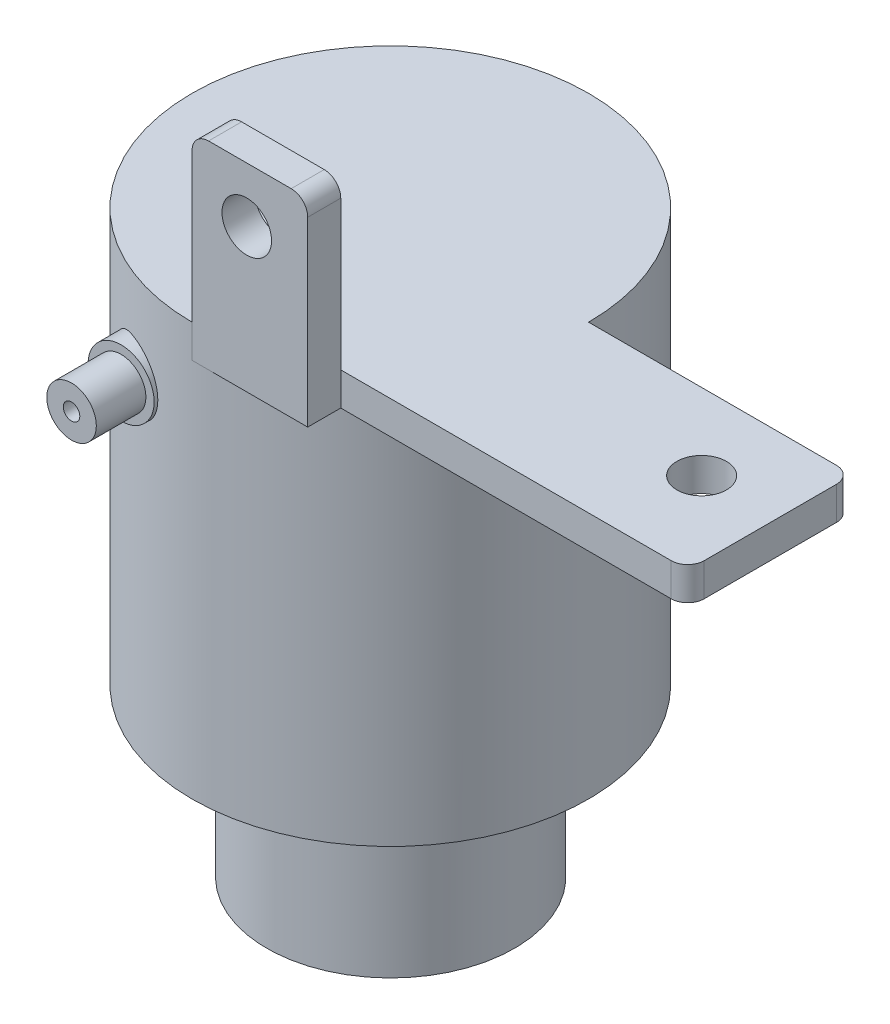
ISO-10303-21;
HEADER;
FILE_DESCRIPTION(('STEP AP214'),'2;1');
FILE_NAME('part.step','',(''),(''),'','','');
FILE_SCHEMA(('AUTOMOTIVE_DESIGN { 1 0 10303 214 1 1 1 1 }'));
ENDSEC;
DATA;
#1=APPLICATION_CONTEXT('core data for automotive mechanical design processes');
#2=APPLICATION_PROTOCOL_DEFINITION('international standard','automotive_design',2000,#1);
#3=PRODUCT_CONTEXT('',#1,'mechanical');
#4=PRODUCT('Part','Part','',(#3));
#5=PRODUCT_RELATED_PRODUCT_CATEGORY('part','',(#4));
#6=PRODUCT_DEFINITION_FORMATION('','',#4);
#7=PRODUCT_DEFINITION_CONTEXT('part definition',#1,'design');
#8=PRODUCT_DEFINITION('design','',#6,#7);
#9=PRODUCT_DEFINITION_SHAPE('','',#8);
#10=(LENGTH_UNIT() NAMED_UNIT(*) SI_UNIT(.MILLI.,.METRE.));
#11=(NAMED_UNIT(*) PLANE_ANGLE_UNIT() SI_UNIT($,.RADIAN.));
#12=(NAMED_UNIT(*) SI_UNIT($,.STERADIAN.) SOLID_ANGLE_UNIT());
#13=UNCERTAINTY_MEASURE_WITH_UNIT(LENGTH_MEASURE(1.E-05),#10,'distance_accuracy_value','');
#14=(GEOMETRIC_REPRESENTATION_CONTEXT(3) GLOBAL_UNCERTAINTY_ASSIGNED_CONTEXT((#13)) GLOBAL_UNIT_ASSIGNED_CONTEXT((#10,
#11,#12)) REPRESENTATION_CONTEXT('',''));
#15=CARTESIAN_POINT('',(0.,0.,0.));
#16=DIRECTION('',(0.,0.,1.));
#17=DIRECTION('',(1.,0.,0.));
#18=AXIS2_PLACEMENT_3D('',#15,#16,#17);
#19=CARTESIAN_POINT('',(-4.00939344564377,-96.6692765539277,-12.1304033412201));
#20=DIRECTION('',(0.,1.,0.));
#21=DIRECTION('',(0.,0.,1.));
#22=AXIS2_PLACEMENT_3D('',#19,#20,#21);
#23=CYLINDRICAL_SURFACE('',#22,84.);
#24=CARTESIAN_POINT('',(-4.00939344564377,78.3307234460723,-12.1304033412201));
#25=DIRECTION('',(0.,1.,0.));
#26=DIRECTION('',(0.,0.,1.));
#27=AXIS2_PLACEMENT_3D('',#24,#25,#26);
#28=CIRCLE('',#27,84.);
#29=CARTESIAN_POINT('',(79.9906065543562,78.3307234460723,-12.1304033412201));
#30=VERTEX_POINT('',#29);
#31=CARTESIAN_POINT('',(-4.00939344564377,78.3307234460723,71.8695966587799));
#32=VERTEX_POINT('',#31);
#33=EDGE_CURVE('E148',#30,#32,#28,.T.);
#34=ORIENTED_EDGE('',*,*,#33,.F.);
#35=DIRECTION('',(0.,1.,0.));
#36=VECTOR('',#35,1.);
#37=CARTESIAN_POINT('',(79.9906065543562,-96.6692765539277,-12.1304033412201));
#38=LINE('',#37,#36);
#39=CARTESIAN_POINT('',(79.9906065543562,64.3307234460723,-12.1304033412201));
#40=VERTEX_POINT('',#39);
#41=EDGE_CURVE('E173',#30,#40,#38,.F.);
#42=ORIENTED_EDGE('',*,*,#41,.T.);
#43=CARTESIAN_POINT('',(-4.00939344564377,64.3307234460723,-12.1304033412201));
#44=DIRECTION('',(0.,1.,0.));
#45=DIRECTION('',(0.,0.,1.));
#46=AXIS2_PLACEMENT_3D('',#43,#44,#45);
#47=CIRCLE('',#46,84.);
#48=CARTESIAN_POINT('',(-4.00939344564377,64.3307234460723,71.8695966587799));
#49=VERTEX_POINT('',#48);
#50=EDGE_CURVE('E151',#49,#40,#47,.T.);
#51=ORIENTED_EDGE('',*,*,#50,.F.);
#52=DIRECTION('',(0.,-1.,0.));
#53=VECTOR('',#52,1.);
#54=CARTESIAN_POINT('',(-4.00939344564377,64.3307234460723,71.8695966587799));
#55=LINE('',#54,#53);
#56=EDGE_CURVE('E135',#32,#49,#55,.T.);
#57=ORIENTED_EDGE('',*,*,#56,.F.);
#58=EDGE_LOOP('',(#34,#42,#51,#57));
#59=FACE_BOUND('',#58,.T.);
#60=CARTESIAN_POINT('',(-4.00939344564377,-96.6692765539277,-12.1304033412201));
#61=DIRECTION('',(0.,1.,0.));
#62=DIRECTION('',(0.,0.,1.));
#63=AXIS2_PLACEMENT_3D('',#60,#61,#62);
#64=CIRCLE('',#63,84.);
#65=CARTESIAN_POINT('',(-4.00939344564377,-96.6692765539277,71.8695966587799));
#66=VERTEX_POINT('',#65);
#67=EDGE_CURVE('E164',#66,#66,#64,.T.);
#68=ORIENTED_EDGE('',*,*,#67,.T.);
#69=EDGE_LOOP('',(#68));
#70=FACE_BOUND('',#69,.T.);
#71=CARTESIAN_POINT('',(-48.0745118024601,40.9985069538936,59.3836885861739));
#72=CARTESIAN_POINT('',(-48.0745185371785,41.3533320048685,59.3836829810344));
#73=CARTESIAN_POINT('',(-48.06101080227,41.7080873698228,59.3920124379609));
#74=CARTESIAN_POINT('',(-48.0071860703539,42.4149002024277,59.4251365611333));
#75=CARTESIAN_POINT('',(-47.9668625635464,42.7669569939753,59.4499352254437));
#76=CARTESIAN_POINT('',(-47.8599096398544,43.4658841899632,59.5155046929798));
#77=CARTESIAN_POINT('',(-47.7932538210653,43.8127490253312,59.5562915263106));
#78=CARTESIAN_POINT('',(-47.63454036209,44.4984295730678,59.6529873291647));
#79=CARTESIAN_POINT('',(-47.5424839769149,44.8372456822159,59.7088955515559));
#80=CARTESIAN_POINT('',(-47.3345609505447,45.5032014691506,59.8344806376597));
#81=CARTESIAN_POINT('',(-47.2187979067674,45.8303849166348,59.904097545587));
#82=CARTESIAN_POINT('',(-46.9645196155599,46.4727213748997,60.0560154096472));
#83=CARTESIAN_POINT('',(-46.8260041682698,46.7878742799728,60.1383164771989));
#84=CARTESIAN_POINT('',(-46.5276342985117,47.4045235770432,60.3142594512845));
#85=CARTESIAN_POINT('',(-46.3677834942102,47.7060222730104,60.4078994346539));
#86=CARTESIAN_POINT('',(-46.0280782140283,48.2942356167696,60.6052049796269));
#87=CARTESIAN_POINT('',(-45.8482160220058,48.5809444989905,60.7088744064351));
#88=CARTESIAN_POINT('',(-45.4567368974437,49.1578446868984,60.9323914678286));
#89=CARTESIAN_POINT('',(-45.2437802606205,49.44688484563,61.0528631360036));
#90=CARTESIAN_POINT('',(-44.7982178753027,50.005720321412,61.3021302070841));
#91=CARTESIAN_POINT('',(-44.5656054507967,50.2755090419359,61.430928434555));
#92=CARTESIAN_POINT('',(-44.0823250297289,50.7949108781494,61.6953104605126));
#93=CARTESIAN_POINT('',(-43.8316537803295,51.0445203417899,61.830895480118));
#94=CARTESIAN_POINT('',(-43.3137927287167,51.5227613534907,62.1073927663208));
#95=CARTESIAN_POINT('',(-43.0466021472425,51.7513919106544,62.2483052841085));
#96=CARTESIAN_POINT('',(-42.4596342302265,52.2167268512582,62.5536162469773));
#97=CARTESIAN_POINT('',(-42.1376551990175,52.4502786617011,62.7185964510598));
#98=CARTESIAN_POINT('',(-41.4763180624738,52.8884432410142,63.0518196091505));
#99=CARTESIAN_POINT('',(-41.1369636051738,53.0930620508142,63.2200618737058));
#100=CARTESIAN_POINT('',(-40.4425111927271,53.4726917689092,63.5582826424593));
#101=CARTESIAN_POINT('',(-40.0874015318331,53.6476801813661,63.7282623628662));
#102=CARTESIAN_POINT('',(-39.3637883257998,53.9669260802625,64.0681958467769));
#103=CARTESIAN_POINT('',(-38.995289147123,54.1111934817033,64.2381496009114));
#104=CARTESIAN_POINT('',(-38.2183539899061,54.3779621539463,64.5894914594123));
#105=CARTESIAN_POINT('',(-37.8090106672718,54.4979775384892,64.7707674578722));
#106=CARTESIAN_POINT('',(-36.9796639801391,54.7004156364425,65.1299712886171));
#107=CARTESIAN_POINT('',(-36.559659995531,54.7828361577197,65.3078989250814));
#108=CARTESIAN_POINT('',(-35.7118398414194,54.9090362948267,65.658833441201));
#109=CARTESIAN_POINT('',(-35.2840236192153,54.9528156498885,65.831840287641));
#110=CARTESIAN_POINT('',(-34.4236646716375,55.0007818188149,66.1714866118659));
#111=CARTESIAN_POINT('',(-33.9911221209277,55.0049700908668,66.338126323935));
#112=CARTESIAN_POINT('',(-33.1315038127928,54.9732259810708,66.6611581298369));
#113=CARTESIAN_POINT('',(-32.7044501603484,54.9379288919411,66.8176708384612));
#114=CARTESIAN_POINT('',(-31.8523964595786,54.8277051563706,67.1221792480283));
#115=CARTESIAN_POINT('',(-31.4273964181709,54.7527783765277,67.270174920299));
#116=CARTESIAN_POINT('',(-30.5832601556587,54.5631017268957,67.5566609349456));
#117=CARTESIAN_POINT('',(-30.164122040835,54.4483650421746,67.6951544062896));
#118=CARTESIAN_POINT('',(-29.335442495145,54.1792113422142,67.9619226300786));
#119=CARTESIAN_POINT('',(-28.9259004052824,54.0247970605561,68.0901980856947));
#120=CARTESIAN_POINT('',(-28.1471980276106,53.6884515799436,68.3277906325311));
#121=CARTESIAN_POINT('',(-27.7771630962197,53.5090319155961,68.4378011414181));
#122=CARTESIAN_POINT('',(-27.0522338099615,53.1169800353188,68.6481206525346));
#123=CARTESIAN_POINT('',(-26.6973388359248,52.9043491792673,68.7484300517174));
#124=CARTESIAN_POINT('',(-26.0060628696846,52.4471667389018,68.9391661566541));
#125=CARTESIAN_POINT('',(-25.6696769878071,52.2026236431814,69.0295954787787));
#126=CARTESIAN_POINT('',(-25.0185204523634,51.6831899038315,69.200586522511));
#127=CARTESIAN_POINT('',(-24.7037489550203,51.4083004459496,69.2811486294091));
#128=CARTESIAN_POINT('',(-24.1161999384741,50.8467351305046,69.4281814993576));
#129=CARTESIAN_POINT('',(-23.8420498626785,50.5616356270546,69.4951950137088));
#130=CARTESIAN_POINT('',(-23.3180508347961,49.9681901339464,69.6207333475101));
#131=CARTESIAN_POINT('',(-23.0682008814551,49.6598451030193,69.6792585167602));
#132=CARTESIAN_POINT('',(-22.5950099578225,49.0221388158126,69.7880550050499));
#133=CARTESIAN_POINT('',(-22.3716656739455,48.6927801944629,69.838327356111));
#134=CARTESIAN_POINT('',(-21.9533998318556,48.0154206298018,69.9309062990994));
#135=CARTESIAN_POINT('',(-21.7584780080625,47.6674198607248,69.9732129654595));
#136=CARTESIAN_POINT('',(-21.4036271728893,46.9650213721491,70.0491115722948));
#137=CARTESIAN_POINT('',(-21.2428936567747,46.6110519156632,70.0829084410756));
#138=CARTESIAN_POINT('',(-20.9512540737091,45.89045714148,70.1435023479722));
#139=CARTESIAN_POINT('',(-20.8203473807045,45.523832089605,70.1702995330104));
#140=CARTESIAN_POINT('',(-20.5894308302362,44.7805734521763,70.2171300298544));
#141=CARTESIAN_POINT('',(-20.4894197467886,44.4039402644047,70.2371636100532));
#142=CARTESIAN_POINT('',(-20.3210972706126,43.6433676498071,70.2706627519687));
#143=CARTESIAN_POINT('',(-20.2527858832893,43.2594282217352,70.2841283125656));
#144=CARTESIAN_POINT('',(-20.1488202780001,42.4900294709585,70.3045509497591));
#145=CARTESIAN_POINT('',(-20.1129160444299,42.1046052306833,70.3115578627847));
#146=CARTESIAN_POINT('',(-20.073141995697,41.332046417024,70.3193170728606));
#147=CARTESIAN_POINT('',(-20.0692719623993,40.9449118553042,70.3200694125012));
#148=CARTESIAN_POINT('',(-20.0935964328707,40.1716949981188,70.3153276947922));
#149=CARTESIAN_POINT('',(-20.1217905260471,39.7856126892422,70.3098337174291));
#150=CARTESIAN_POINT('',(-20.2100195033879,39.0172457909177,70.2925408616762));
#151=CARTESIAN_POINT('',(-20.2700544122225,38.6349612044125,70.2807419784014));
#152=CARTESIAN_POINT('',(-20.4213996352495,37.877358162748,70.250735202608));
#153=CARTESIAN_POINT('',(-20.5126731300712,37.5020320525163,70.2325348544826));
#154=CARTESIAN_POINT('',(-20.7257850871442,36.7605477768096,70.1895459681268));
#155=CARTESIAN_POINT('',(-20.8476234854548,36.3943895921574,70.1647574436787));
#156=CARTESIAN_POINT('',(-21.120888402552,35.6738375699762,70.1083721078625));
#157=CARTESIAN_POINT('',(-21.2723142348275,35.3194434597109,70.0767754544604));
#158=CARTESIAN_POINT('',(-21.6035385792372,34.6249011098655,70.0065231886587));
#159=CARTESIAN_POINT('',(-21.7833371237169,34.2847528865265,69.9678675682119));
#160=CARTESIAN_POINT('',(-22.1701435778227,33.620571841485,69.8831710890105));
#161=CARTESIAN_POINT('',(-22.377191858111,33.2965639332649,69.8371192499598));
#162=CARTESIAN_POINT('',(-22.8166031016899,32.6674378479661,69.7374145015534));
#163=CARTESIAN_POINT('',(-23.0489660312977,32.3623196457542,69.6837616023114));
#164=CARTESIAN_POINT('',(-23.5371083015719,31.7730252837142,69.568624881425));
#165=CARTESIAN_POINT('',(-23.7928871511906,31.4888486849521,69.5071412239862));
#166=CARTESIAN_POINT('',(-24.3257869124345,30.9432707111443,69.3761572545259));
#167=CARTESIAN_POINT('',(-24.6029079609649,30.6818694822201,69.3066568910778));
#168=CARTESIAN_POINT('',(-25.178745388788,30.18129194302,69.1588803027694));
#169=CARTESIAN_POINT('',(-25.4776282810354,29.9423281510652,69.0805331648076));
#170=CARTESIAN_POINT('',(-26.0924118757365,29.4906145853644,68.9155192959255));
#171=CARTESIAN_POINT('',(-26.4083126156668,29.2778648693506,68.8288525466834));
#172=CARTESIAN_POINT('',(-27.0546405796088,28.8796998849332,68.6472498217527));
#173=CARTESIAN_POINT('',(-27.3850684347263,28.694285805606,68.5523134866299));
#174=CARTESIAN_POINT('',(-28.0578918529696,28.3516568831111,68.3543324312234));
#175=CARTESIAN_POINT('',(-28.4002876364162,28.1944425594069,68.2512875616238));
#176=CARTESIAN_POINT('',(-29.1039595806575,27.9049104495359,68.0344389257392));
#177=CARTESIAN_POINT('',(-29.4654959792042,27.7733874964879,67.9204185488854));
#178=CARTESIAN_POINT('',(-30.1957915540292,27.5410789995939,67.6845063294036));
#179=CARTESIAN_POINT('',(-30.5645508310981,27.440293885,67.5626143768782));
#180=CARTESIAN_POINT('',(-31.3067165144118,27.2695476446059,67.3114599346531));
#181=CARTESIAN_POINT('',(-31.6801235844432,27.1995909748158,67.1821963824941));
#182=CARTESIAN_POINT('',(-32.4290435660779,27.0903920593567,66.9169326586531));
#183=CARTESIAN_POINT('',(-32.8045566400224,27.0511522152038,66.7809319611284));
#184=CARTESIAN_POINT('',(-33.5754802629301,27.0017908721176,66.4954473040281));
#185=CARTESIAN_POINT('',(-33.970875660021,26.9933474603474,66.3456315203428));
#186=CARTESIAN_POINT('',(-34.7587516965035,27.0096867502784,66.0402784880127));
#187=CARTESIAN_POINT('',(-35.1512322431868,27.0344705042735,65.8847410583169));
#188=CARTESIAN_POINT('',(-35.9309578521109,27.1166005320175,65.5689576090649));
#189=CARTESIAN_POINT('',(-36.3182016138194,27.1739547477898,65.4087104501228));
#190=CARTESIAN_POINT('',(-37.0851219094717,27.3204714204781,65.0846827116464));
#191=CARTESIAN_POINT('',(-37.464798099611,27.409635319087,64.9209019722778));
#192=CARTESIAN_POINT('',(-38.2393504903571,27.6259106850859,64.5800959142851));
#193=CARTESIAN_POINT('',(-38.6335652980294,27.7551462990799,64.4029124612003));
#194=CARTESIAN_POINT('',(-39.4086048724799,28.0478673217371,64.0475305864781));
#195=CARTESIAN_POINT('',(-39.7894290179677,28.2113543171298,63.8693321181913));
#196=CARTESIAN_POINT('',(-40.53544625474,28.571603268918,63.5136199993482));
#197=CARTESIAN_POINT('',(-40.9006363622336,28.7683715419553,63.3361064853472));
#198=CARTESIAN_POINT('',(-41.6131972565618,29.1942454873757,62.9835902618356));
#199=CARTESIAN_POINT('',(-41.9605598353402,29.4233658762302,62.8085887351219));
#200=CARTESIAN_POINT('',(-42.6456141720262,29.9205605829677,62.4577669157834));
#201=CARTESIAN_POINT('',(-42.9826584351333,30.1896331994836,62.2820938931676));
#202=CARTESIAN_POINT('',(-43.6323819428274,30.7596676603189,61.9381720829945));
#203=CARTESIAN_POINT('',(-43.945072993327,31.0606138839027,61.7699197154383));
#204=CARTESIAN_POINT('',(-44.5437134324818,31.6933740574208,61.4432685127777));
#205=CARTESIAN_POINT('',(-44.8296509497028,32.0252015813713,61.2848740622997));
#206=CARTESIAN_POINT('',(-45.2360185633982,32.5445663771728,61.0569558977537));
#207=CARTESIAN_POINT('',(-45.367715427351,32.7212879020404,60.9825969080452));
#208=CARTESIAN_POINT('',(-45.6233126103842,33.0818125348598,60.8374206101365));
#209=CARTESIAN_POINT('',(-45.7472096244708,33.2656185922276,60.7666048058476));
#210=CARTESIAN_POINT('',(-46.0913262591282,33.8034162496245,60.5688254324341));
#211=CARTESIAN_POINT('',(-46.3012423618047,34.1659365412059,60.4467974447678));
#212=CARTESIAN_POINT('',(-46.6894121197608,34.912355472205,60.2192109149452));
#213=CARTESIAN_POINT('',(-46.8676722367392,35.2962497276527,60.113649012227));
#214=CARTESIAN_POINT('',(-47.1896185460312,36.0818332939059,59.921683713464));
#215=CARTESIAN_POINT('',(-47.3333854020802,36.4834784341397,59.8352356569226));
#216=CARTESIAN_POINT('',(-47.5843818277945,37.3016925141942,59.6835362392068));
#217=CARTESIAN_POINT('',(-47.6916310623103,37.7182532879046,59.6182734705761));
#218=CARTESIAN_POINT('',(-47.8770867414274,38.6075636173896,59.5050533702216));
#219=CARTESIAN_POINT('',(-47.9509628239046,39.0815594058521,59.4596918385683));
#220=CARTESIAN_POINT('',(-48.0496692371887,40.0365820804258,59.399014196519));
#221=CARTESIAN_POINT('',(-48.0745026748196,40.5176085192043,59.3836961828835));
#222=CARTESIAN_POINT('',(-48.0745118024601,40.9985069538936,59.3836885861739));
#223=B_SPLINE_CURVE_WITH_KNOTS('',3,(#71,#72,#73,#74,#75,#76,#77,#78,#79,#80,#81,#82,#83,#84,
#85,#86,#87,#88,#89,#90,#91,#92,#93,#94,#95,#96,#97,#98,#99,#100,#101,#102,#103,#104,#105,#106,
#107,#108,#109,#110,#111,#112,#113,#114,#115,#116,#117,#118,#119,#120,#121,#122,#123,#124,#125,
#126,#127,#128,#129,#130,#131,#132,#133,#134,#135,#136,#137,#138,#139,#140,#141,#142,#143,#144,
#145,#146,#147,#148,#149,#150,#151,#152,#153,#154,#155,#156,#157,#158,#159,#160,#161,#162,#163,
#164,#165,#166,#167,#168,#169,#170,#171,#172,#173,#174,#175,#176,#177,#178,#179,#180,#181,#182,
#183,#184,#185,#186,#187,#188,#189,#190,#191,#192,#193,#194,#195,#196,#197,#198,#199,#200,#201,
#202,#203,#204,#205,#206,#207,#208,#209,#210,#211,#212,#213,#214,#215,#216,#217,#218,#219,#220,
#221,#222),.UNSPECIFIED.,.T.,.F.,(4,2,2,2,2,2,2,2,2,2,2,2,2,2,2,2,2,2,2,2,2,2,2,2,2,2,2,2,2,2,2,
2,2,2,2,2,2,2,2,2,2,2,2,2,2,2,2,2,2,2,2,2,2,2,2,2,2,2,2,2,2,2,2,2,2,2,2,2,2,2,2,2,2,2,2,4),(0.,
1.06400280685061,2.12826400547629,3.19359499733874,4.25887336191674,5.3195921966704,
6.38032034940268,7.44086884607245,8.50182770363306,9.63676488294703,10.7720891006903,
11.9076183319709,13.043201170118,14.3336812830286,15.6238915570999,16.9150770282049,
18.2058451440925,19.5946635335197,20.9835628937387,22.3724716268076,23.7613292044976,
25.1281583665292,26.4949921296348,27.8613736278978,29.2276610147734,30.5031243821014,
31.778535537498,33.0536081249167,34.3286309080335,35.5306405023939,36.732600548539,
37.9344101739485,39.1362085688989,40.3054700978695,41.4747070822252,42.6438976635504,
43.813088444232,44.9731800487119,46.1332637536049,47.2933326033736,48.4534023519592,
49.6121094659837,50.7708141560534,51.9294919641313,53.0881710931311,54.2485865534838,
55.4090004698455,56.5693900571194,57.7297870886395,58.90025252606,60.0707205411867,
61.2412394556441,62.4117799298421,63.6142057740795,64.8166484093622,66.0192647913429,
67.2219751874034,68.489317187549,69.7566993249624,71.0243906352474,72.2921394077111,
73.6439476713906,74.9958185727856,76.3479463419053,77.7006911661908,79.0959699558674,
80.4905680788681,81.8857821254818,82.5833594504352,83.2812303942491,84.5881544639028,
85.8948114535412,87.1983823267492,88.5012501087381,89.9433965988896,91.3854517269408),.UNSPECIFIED.);
#224=CARTESIAN_POINT('',(-48.0745118024601,40.9985069538936,59.3836885861739));
#225=VERTEX_POINT('',#224);
#226=EDGE_CURVE('E270',#225,#225,#223,.T.);
#227=ORIENTED_EDGE('',*,*,#226,.T.);
#228=EDGE_LOOP('',(#227));
#229=FACE_BOUND('',#228,.T.);
#230=ADVANCED_FACE('F40',(#59,#70,#229),#23,.T.);
#231=CARTESIAN_POINT('',(-4.00939344564377,78.3307234460723,57.8695966587799));
#232=DIRECTION('',(0.,0.,-1.));
#233=DIRECTION('',(-1.,0.,0.));
#234=AXIS2_PLACEMENT_3D('',#231,#232,#233);
#235=PLANE('',#234);
#236=DIRECTION('',(1.,0.,0.));
#237=VECTOR('',#236,1.);
#238=CARTESIAN_POINT('',(-4.00939344564377,64.3307234460723,57.8695966587799));
#239=LINE('',#238,#237);
#240=CARTESIAN_POINT('',(44.9906065543562,64.3307234460723,57.8695966587799));
#241=VERTEX_POINT('',#240);
#242=CARTESIAN_POINT('',(184.990606554356,64.3307234460723,57.8695966587799));
#243=VERTEX_POINT('',#242);
#244=EDGE_CURVE('E206',#241,#243,#239,.T.);
#245=ORIENTED_EDGE('',*,*,#244,.T.);
#246=DIRECTION('',(0.,-1.,0.));
#247=VECTOR('',#246,1.);
#248=CARTESIAN_POINT('',(184.990606554356,78.3307234460723,57.8695966587799));
#249=LINE('',#248,#247);
#250=CARTESIAN_POINT('',(184.990606554356,78.3307234460723,57.8695966587799));
#251=VERTEX_POINT('',#250);
#252=EDGE_CURVE('E245',#243,#251,#249,.F.);
#253=ORIENTED_EDGE('',*,*,#252,.T.);
#254=DIRECTION('',(1.,0.,0.));
#255=VECTOR('',#254,1.);
#256=CARTESIAN_POINT('',(-4.00939344564377,78.3307234460723,57.8695966587799));
#257=LINE('',#256,#255);
#258=CARTESIAN_POINT('',(44.9906065543562,78.3307234460723,57.8695966587799));
#259=VERTEX_POINT('',#258);
#260=EDGE_CURVE('E209',#259,#251,#257,.T.);
#261=ORIENTED_EDGE('',*,*,#260,.F.);
#262=DIRECTION('',(0.,1.,0.));
#263=VECTOR('',#262,1.);
#264=CARTESIAN_POINT('',(44.9906065543562,64.3307234460723,57.8695966587799));
#265=LINE('',#264,#263);
#266=EDGE_CURVE('E193',#241,#259,#265,.T.);
#267=ORIENTED_EDGE('',*,*,#266,.F.);
#268=EDGE_LOOP('',(#245,#253,#261,#267));
#269=FACE_BOUND('',#268,.T.);
#270=ADVANCED_FACE('F326',(#269),#235,.F.);
#271=CARTESIAN_POINT('',(-4.00939344564377,78.3307234460723,-12.1304033412201));
#272=DIRECTION('',(0.,0.,-1.));
#273=DIRECTION('',(-1.,0.,0.));
#274=AXIS2_PLACEMENT_3D('',#271,#272,#273);
#275=PLANE('',#274);
#276=DIRECTION('',(1.,0.,0.));
#277=VECTOR('',#276,1.);
#278=CARTESIAN_POINT('',(-4.00939344564377,78.3307234460723,-12.1304033412201));
#279=LINE('',#278,#277);
#280=CARTESIAN_POINT('',(184.990606554356,78.3307234460723,-12.1304033412201));
#281=VERTEX_POINT('',#280);
#282=EDGE_CURVE('E162',#30,#281,#279,.T.);
#283=ORIENTED_EDGE('',*,*,#282,.T.);
#284=DIRECTION('',(0.,-1.,0.));
#285=VECTOR('',#284,1.);
#286=CARTESIAN_POINT('',(184.990606554356,64.3307234460723,-12.1304033412201));
#287=LINE('',#286,#285);
#288=CARTESIAN_POINT('',(184.990606554356,64.3307234460723,-12.1304033412201));
#289=VERTEX_POINT('',#288);
#290=EDGE_CURVE('E223',#281,#289,#287,.T.);
#291=ORIENTED_EDGE('',*,*,#290,.T.);
#292=DIRECTION('',(1.,0.,0.));
#293=VECTOR('',#292,1.);
#294=CARTESIAN_POINT('',(-4.00939344564377,64.3307234460723,-12.1304033412201));
#295=LINE('',#294,#293);
#296=EDGE_CURVE('E202',#40,#289,#295,.T.);
#297=ORIENTED_EDGE('',*,*,#296,.F.);
#298=ORIENTED_EDGE('',*,*,#41,.F.);
#299=EDGE_LOOP('',(#283,#291,#297,#298));
#300=FACE_BOUND('',#299,.T.);
#301=ADVANCED_FACE('F330',(#300),#275,.T.);
#302=CARTESIAN_POINT('',(-4.00939344564377,78.3307234460723,57.8695966587799));
#303=DIRECTION('',(-1.,0.,0.));
#304=DIRECTION('',(0.,0.,1.));
#305=AXIS2_PLACEMENT_3D('',#302,#303,#304);
#306=PLANE('',#305);
#307=CARTESIAN_POINT('',(-4.00939344564377,141.330723446072,71.8695966587799));
#308=VERTEX_POINT('',#307);
#309=EDGE_CURVE('E132',#308,#32,#55,.T.);
#310=ORIENTED_EDGE('',*,*,#309,.F.);
#311=DIRECTION('',(0.,0.,-1.));
#312=VECTOR('',#311,1.);
#313=CARTESIAN_POINT('',(-4.00939344564377,141.330723446072,57.8695966587799));
#314=LINE('',#313,#312);
#315=CARTESIAN_POINT('',(-4.00939344564377,141.330723446072,57.8695966587799));
#316=VERTEX_POINT('',#315);
#317=EDGE_CURVE('E264',#308,#316,#314,.T.);
#318=ORIENTED_EDGE('',*,*,#317,.T.);
#319=DIRECTION('',(0.,-1.,0.));
#320=VECTOR('',#319,1.);
#321=CARTESIAN_POINT('',(-4.00939344564377,64.3307234460723,57.8695966587799));
#322=LINE('',#321,#320);
#323=CARTESIAN_POINT('',(-4.00939344564377,78.3307234460723,57.8695966587799));
#324=VERTEX_POINT('',#323);
#325=EDGE_CURVE('E168',#316,#324,#322,.T.);
#326=ORIENTED_EDGE('',*,*,#325,.T.);
#327=DIRECTION('',(0.,0.,-1.));
#328=VECTOR('',#327,1.);
#329=CARTESIAN_POINT('',(-4.00939344564377,78.3307234460723,57.8695966587799));
#330=LINE('',#329,#328);
#331=EDGE_CURVE('E159',#32,#324,#330,.T.);
#332=ORIENTED_EDGE('',*,*,#331,.F.);
#333=EDGE_LOOP('',(#310,#318,#326,#332));
#334=FACE_BOUND('',#333,.T.);
#335=ADVANCED_FACE('F167',(#334),#306,.T.);
#336=CARTESIAN_POINT('',(191.990606554356,78.3307234460723,57.8695966587799));
#337=DIRECTION('',(-1.,0.,0.));
#338=DIRECTION('',(0.,0.,1.));
#339=AXIS2_PLACEMENT_3D('',#336,#337,#338);
#340=PLANE('',#339);
#341=DIRECTION('',(0.,0.,-1.));
#342=VECTOR('',#341,1.);
#343=CARTESIAN_POINT('',(191.990606554356,78.3307234460723,57.8695966587799));
#344=LINE('',#343,#342);
#345=CARTESIAN_POINT('',(191.990606554356,78.3307234460723,50.8695966587799));
#346=VERTEX_POINT('',#345);
#347=CARTESIAN_POINT('',(191.990606554356,78.3307234460723,-5.13040334122015));
#348=VERTEX_POINT('',#347);
#349=EDGE_CURVE('E205',#346,#348,#344,.T.);
#350=ORIENTED_EDGE('',*,*,#349,.F.);
#351=DIRECTION('',(0.,-1.,0.));
#352=VECTOR('',#351,1.);
#353=CARTESIAN_POINT('',(191.990606554356,78.3307234460723,50.8695966587799));
#354=LINE('',#353,#352);
#355=CARTESIAN_POINT('',(191.990606554356,64.3307234460723,50.8695966587799));
#356=VERTEX_POINT('',#355);
#357=EDGE_CURVE('E238',#346,#356,#354,.T.);
#358=ORIENTED_EDGE('',*,*,#357,.T.);
#359=DIRECTION('',(0.,0.,-1.));
#360=VECTOR('',#359,1.);
#361=CARTESIAN_POINT('',(191.990606554356,64.3307234460723,57.8695966587799));
#362=LINE('',#361,#360);
#363=CARTESIAN_POINT('',(191.990606554356,64.3307234460723,-5.13040334122015));
#364=VERTEX_POINT('',#363);
#365=EDGE_CURVE('E217',#356,#364,#362,.T.);
#366=ORIENTED_EDGE('',*,*,#365,.T.);
#367=DIRECTION('',(0.,-1.,0.));
#368=VECTOR('',#367,1.);
#369=CARTESIAN_POINT('',(191.990606554356,78.3307234460723,-5.13040334122015));
#370=LINE('',#369,#368);
#371=EDGE_CURVE('E231',#364,#348,#370,.F.);
#372=ORIENTED_EDGE('',*,*,#371,.T.);
#373=EDGE_LOOP('',(#350,#358,#366,#372));
#374=FACE_BOUND('',#373,.T.);
#375=ADVANCED_FACE('F341',(#374),#340,.F.);
#376=CARTESIAN_POINT('',(-4.00939344564377,78.3307234460723,57.8695966587799));
#377=DIRECTION('',(0.,1.,0.));
#378=DIRECTION('',(0.,0.,1.));
#379=AXIS2_PLACEMENT_3D('',#376,#377,#378);
#380=PLANE('',#379);
#381=CARTESIAN_POINT('',(160.256658073003,78.3307234460723,20.230110680193));
#382=DIRECTION('',(0.,1.,0.));
#383=DIRECTION('',(0.,0.,1.));
#384=AXIS2_PLACEMENT_3D('',#381,#382,#383);
#385=CIRCLE('',#384,10.5);
#386=CARTESIAN_POINT('',(160.256658073003,78.3307234460723,30.730110680193));
#387=VERTEX_POINT('',#386);
#388=EDGE_CURVE('E390',#387,#387,#385,.T.);
#389=ORIENTED_EDGE('',*,*,#388,.F.);
#390=EDGE_LOOP('',(#389));
#391=FACE_BOUND('',#390,.T.);
#392=ORIENTED_EDGE('',*,*,#260,.T.);
#393=CARTESIAN_POINT('',(184.990606554356,78.3307234460723,50.8695966587799));
#394=DIRECTION('',(0.,1.,0.));
#395=DIRECTION('',(0.,0.,1.));
#396=AXIS2_PLACEMENT_3D('',#393,#394,#395);
#397=CIRCLE('',#396,7.);
#398=EDGE_CURVE('E248',#251,#346,#397,.T.);
#399=ORIENTED_EDGE('',*,*,#398,.T.);
#400=ORIENTED_EDGE('',*,*,#349,.T.);
#401=CARTESIAN_POINT('',(184.990606554356,78.3307234460723,-5.13040334122015));
#402=DIRECTION('',(0.,1.,0.));
#403=DIRECTION('',(0.,0.,1.));
#404=AXIS2_PLACEMENT_3D('',#401,#402,#403);
#405=CIRCLE('',#404,7.);
#406=EDGE_CURVE('E235',#348,#281,#405,.T.);
#407=ORIENTED_EDGE('',*,*,#406,.T.);
#408=ORIENTED_EDGE('',*,*,#282,.F.);
#409=ORIENTED_EDGE('',*,*,#33,.T.);
#410=ORIENTED_EDGE('',*,*,#331,.T.);
#411=EDGE_CURVE('E210',#324,#259,#257,.T.);
#412=ORIENTED_EDGE('',*,*,#411,.T.);
#413=EDGE_LOOP('',(#392,#399,#400,#407,#408,#409,#410,#412));
#414=FACE_BOUND('',#413,.T.);
#415=ADVANCED_FACE('F158',(#391,#414),#380,.T.);
#416=CARTESIAN_POINT('',(-4.00939344564377,64.3307234460723,57.8695966587799));
#417=DIRECTION('',(0.,1.,0.));
#418=DIRECTION('',(0.,0.,1.));
#419=AXIS2_PLACEMENT_3D('',#416,#417,#418);
#420=PLANE('',#419);
#421=CARTESIAN_POINT('',(160.256658073003,64.3307234460723,20.230110680193));
#422=DIRECTION('',(0.,1.,0.));
#423=DIRECTION('',(0.,0.,1.));
#424=AXIS2_PLACEMENT_3D('',#421,#422,#423);
#425=CIRCLE('',#424,10.5);
#426=CARTESIAN_POINT('',(160.256658073003,64.3307234460723,30.730110680193));
#427=VERTEX_POINT('',#426);
#428=EDGE_CURVE('E278',#427,#427,#425,.T.);
#429=ORIENTED_EDGE('',*,*,#428,.T.);
#430=EDGE_LOOP('',(#429));
#431=FACE_BOUND('',#430,.T.);
#432=ORIENTED_EDGE('',*,*,#365,.F.);
#433=CARTESIAN_POINT('',(184.990606554356,64.3307234460723,50.8695966587799));
#434=DIRECTION('',(0.,1.,0.));
#435=DIRECTION('',(0.,0.,1.));
#436=AXIS2_PLACEMENT_3D('',#433,#434,#435);
#437=CIRCLE('',#436,7.);
#438=EDGE_CURVE('E242',#356,#243,#437,.F.);
#439=ORIENTED_EDGE('',*,*,#438,.T.);
#440=ORIENTED_EDGE('',*,*,#244,.F.);
#441=DIRECTION('',(0.,0.,-1.));
#442=VECTOR('',#441,1.);
#443=CARTESIAN_POINT('',(44.9906065543562,64.3307234460723,71.8695966587799));
#444=LINE('',#443,#442);
#445=CARTESIAN_POINT('',(44.9906065543562,64.3307234460723,71.8695966587799));
#446=VERTEX_POINT('',#445);
#447=EDGE_CURVE('E189',#446,#241,#444,.T.);
#448=ORIENTED_EDGE('',*,*,#447,.F.);
#449=DIRECTION('',(1.,0.,0.));
#450=VECTOR('',#449,1.);
#451=CARTESIAN_POINT('',(-4.00939344564377,64.3307234460723,71.8695966587799));
#452=LINE('',#451,#450);
#453=EDGE_CURVE('E143',#49,#446,#452,.T.);
#454=ORIENTED_EDGE('',*,*,#453,.F.);
#455=ORIENTED_EDGE('',*,*,#50,.T.);
#456=ORIENTED_EDGE('',*,*,#296,.T.);
#457=CARTESIAN_POINT('',(184.990606554356,64.3307234460723,-5.13040334122015));
#458=DIRECTION('',(0.,1.,0.));
#459=DIRECTION('',(0.,0.,1.));
#460=AXIS2_PLACEMENT_3D('',#457,#458,#459);
#461=CIRCLE('',#460,7.);
#462=EDGE_CURVE('E227',#289,#364,#461,.F.);
#463=ORIENTED_EDGE('',*,*,#462,.T.);
#464=EDGE_LOOP('',(#432,#439,#440,#448,#454,#455,#456,#463));
#465=FACE_BOUND('',#464,.T.);
#466=ADVANCED_FACE('F561',(#431,#465),#420,.F.);
#467=CARTESIAN_POINT('',(-4.00939344564377,64.3307234460723,57.8695966587799));
#468=DIRECTION('',(0.,0.,-1.));
#469=DIRECTION('',(-1.,0.,0.));
#470=AXIS2_PLACEMENT_3D('',#467,#468,#469);
#471=PLANE('',#470);
#472=CARTESIAN_POINT('',(19.1634133933548,125.00536215969,57.8695966587799));
#473=DIRECTION('',(0.,0.,1.));
#474=DIRECTION('',(1.,0.,0.));
#475=AXIS2_PLACEMENT_3D('',#472,#473,#474);
#476=CIRCLE('',#475,10.5);
#477=CARTESIAN_POINT('',(29.6634133933548,125.00536215969,57.8695966587799));
#478=VERTEX_POINT('',#477);
#479=EDGE_CURVE('E386',#478,#478,#476,.T.);
#480=ORIENTED_EDGE('',*,*,#479,.T.);
#481=EDGE_LOOP('',(#480));
#482=FACE_BOUND('',#481,.T.);
#483=ORIENTED_EDGE('',*,*,#325,.F.);
#484=CARTESIAN_POINT('',(2.99060655435623,141.330723446072,57.8695966587799));
#485=DIRECTION('',(0.,0.,-1.));
#486=DIRECTION('',(-1.,0.,0.));
#487=AXIS2_PLACEMENT_3D('',#484,#485,#486);
#488=CIRCLE('',#487,7.);
#489=CARTESIAN_POINT('',(2.99060655435623,148.330723446072,57.8695966587799));
#490=VERTEX_POINT('',#489);
#491=EDGE_CURVE('E65',#316,#490,#488,.T.);
#492=ORIENTED_EDGE('',*,*,#491,.T.);
#493=DIRECTION('',(-1.,0.,0.));
#494=VECTOR('',#493,1.);
#495=CARTESIAN_POINT('',(-4.00939344564377,148.330723446072,57.8695966587799));
#496=LINE('',#495,#494);
#497=CARTESIAN_POINT('',(37.9906065543562,148.330723446072,57.8695966587799));
#498=VERTEX_POINT('',#497);
#499=EDGE_CURVE('E153',#498,#490,#496,.T.);
#500=ORIENTED_EDGE('',*,*,#499,.F.);
#501=CARTESIAN_POINT('',(37.9906065543562,141.330723446072,57.8695966587799));
#502=DIRECTION('',(0.,0.,-1.));
#503=DIRECTION('',(-1.,0.,0.));
#504=AXIS2_PLACEMENT_3D('',#501,#502,#503);
#505=CIRCLE('',#504,7.);
#506=CARTESIAN_POINT('',(44.9906065543562,141.330723446072,57.8695966587799));
#507=VERTEX_POINT('',#506);
#508=EDGE_CURVE('E255',#498,#507,#505,.T.);
#509=ORIENTED_EDGE('',*,*,#508,.T.);
#510=EDGE_CURVE('E192',#259,#507,#265,.T.);
#511=ORIENTED_EDGE('',*,*,#510,.F.);
#512=ORIENTED_EDGE('',*,*,#411,.F.);
#513=EDGE_LOOP('',(#483,#492,#500,#509,#511,#512));
#514=FACE_BOUND('',#513,.T.);
#515=ADVANCED_FACE('F362',(#482,#514),#471,.T.);
#516=CARTESIAN_POINT('',(44.9906065543562,64.3307234460723,71.8695966587799));
#517=DIRECTION('',(-1.,0.,0.));
#518=DIRECTION('',(0.,0.,1.));
#519=AXIS2_PLACEMENT_3D('',#516,#517,#518);
#520=PLANE('',#519);
#521=ORIENTED_EDGE('',*,*,#510,.T.);
#522=DIRECTION('',(0.,0.,-1.));
#523=VECTOR('',#522,1.);
#524=CARTESIAN_POINT('',(44.9906065543562,141.330723446072,71.8695966587799));
#525=LINE('',#524,#523);
#526=CARTESIAN_POINT('',(44.9906065543562,141.330723446072,71.8695966587799));
#527=VERTEX_POINT('',#526);
#528=EDGE_CURVE('E258',#507,#527,#525,.F.);
#529=ORIENTED_EDGE('',*,*,#528,.T.);
#530=DIRECTION('',(0.,1.,0.));
#531=VECTOR('',#530,1.);
#532=CARTESIAN_POINT('',(44.9906065543562,64.3307234460723,71.8695966587799));
#533=LINE('',#532,#531);
#534=EDGE_CURVE('E182',#446,#527,#533,.T.);
#535=ORIENTED_EDGE('',*,*,#534,.F.);
#536=ORIENTED_EDGE('',*,*,#447,.T.);
#537=ORIENTED_EDGE('',*,*,#266,.T.);
#538=EDGE_LOOP('',(#521,#529,#535,#536,#537));
#539=FACE_BOUND('',#538,.T.);
#540=ADVANCED_FACE('F366',(#539),#520,.F.);
#541=CARTESIAN_POINT('',(-4.00939344564377,148.330723446072,71.8695966587799));
#542=DIRECTION('',(0.,-1.,0.));
#543=DIRECTION('',(0.,0.,-1.));
#544=AXIS2_PLACEMENT_3D('',#541,#542,#543);
#545=PLANE('',#544);
#546=ORIENTED_EDGE('',*,*,#499,.T.);
#547=DIRECTION('',(0.,0.,-1.));
#548=VECTOR('',#547,1.);
#549=CARTESIAN_POINT('',(2.99060655435623,148.330723446072,71.8695966587799));
#550=LINE('',#549,#548);
#551=CARTESIAN_POINT('',(2.99060655435623,148.330723446072,71.8695966587799));
#552=VERTEX_POINT('',#551);
#553=EDGE_CURVE('E50',#490,#552,#550,.F.);
#554=ORIENTED_EDGE('',*,*,#553,.T.);
#555=DIRECTION('',(-1.,0.,0.));
#556=VECTOR('',#555,1.);
#557=CARTESIAN_POINT('',(-4.00939344564377,148.330723446072,71.8695966587799));
#558=LINE('',#557,#556);
#559=CARTESIAN_POINT('',(37.9906065543562,148.330723446072,71.8695966587799));
#560=VERTEX_POINT('',#559);
#561=EDGE_CURVE('E186',#560,#552,#558,.T.);
#562=ORIENTED_EDGE('',*,*,#561,.F.);
#563=DIRECTION('',(0.,0.,-1.));
#564=VECTOR('',#563,1.);
#565=CARTESIAN_POINT('',(37.9906065543562,148.330723446072,71.8695966587799));
#566=LINE('',#565,#564);
#567=EDGE_CURVE('E251',#560,#498,#566,.T.);
#568=ORIENTED_EDGE('',*,*,#567,.T.);
#569=EDGE_LOOP('',(#546,#554,#562,#568));
#570=FACE_BOUND('',#569,.T.);
#571=ADVANCED_FACE('F321',(#570),#545,.F.);
#572=CARTESIAN_POINT('',(-4.00939344564377,64.3307234460723,71.8695966587799));
#573=DIRECTION('',(0.,0.,-1.));
#574=DIRECTION('',(-1.,0.,0.));
#575=AXIS2_PLACEMENT_3D('',#572,#573,#574);
#576=PLANE('',#575);
#577=CARTESIAN_POINT('',(19.1634133933548,125.00536215969,71.8695966587799));
#578=DIRECTION('',(0.,0.,1.));
#579=DIRECTION('',(1.,0.,0.));
#580=AXIS2_PLACEMENT_3D('',#577,#578,#579);
#581=CIRCLE('',#580,10.5);
#582=CARTESIAN_POINT('',(29.6634133933548,125.00536215969,71.8695966587799));
#583=VERTEX_POINT('',#582);
#584=EDGE_CURVE('E382',#583,#583,#581,.T.);
#585=ORIENTED_EDGE('',*,*,#584,.F.);
#586=EDGE_LOOP('',(#585));
#587=FACE_BOUND('',#586,.T.);
#588=ORIENTED_EDGE('',*,*,#561,.T.);
#589=CARTESIAN_POINT('',(2.99060655435623,141.330723446072,71.8695966587799));
#590=DIRECTION('',(0.,0.,-1.));
#591=DIRECTION('',(-1.,0.,0.));
#592=AXIS2_PLACEMENT_3D('',#589,#590,#591);
#593=CIRCLE('',#592,7.);
#594=EDGE_CURVE('E11',#552,#308,#593,.F.);
#595=ORIENTED_EDGE('',*,*,#594,.T.);
#596=ORIENTED_EDGE('',*,*,#309,.T.);
#597=ORIENTED_EDGE('',*,*,#56,.T.);
#598=ORIENTED_EDGE('',*,*,#453,.T.);
#599=ORIENTED_EDGE('',*,*,#534,.T.);
#600=CARTESIAN_POINT('',(37.9906065543562,141.330723446072,71.8695966587799));
#601=DIRECTION('',(0.,0.,-1.));
#602=DIRECTION('',(-1.,0.,0.));
#603=AXIS2_PLACEMENT_3D('',#600,#601,#602);
#604=CIRCLE('',#603,7.);
#605=EDGE_CURVE('E261',#527,#560,#604,.F.);
#606=ORIENTED_EDGE('',*,*,#605,.T.);
#607=EDGE_LOOP('',(#588,#595,#596,#597,#598,#599,#606));
#608=FACE_BOUND('',#607,.T.);
#609=ADVANCED_FACE('F134',(#587,#608),#576,.F.);
#610=CARTESIAN_POINT('',(-4.00939344564377,-96.6692765539277,-12.1304033412201));
#611=DIRECTION('',(0.,1.,0.));
#612=DIRECTION('',(0.,0.,1.));
#613=AXIS2_PLACEMENT_3D('',#610,#611,#612);
#614=PLANE('',#613);
#615=CARTESIAN_POINT('',(-3.41288627474214,-96.6692765539277,-11.683022963043));
#616=DIRECTION('',(0.,-1.,0.));
#617=DIRECTION('',(0.,0.,-1.));
#618=AXIS2_PLACEMENT_3D('',#615,#616,#617);
#619=CIRCLE('',#618,52.5);
#620=CARTESIAN_POINT('',(-3.41288627474214,-96.6692765539277,-64.183022963043));
#621=VERTEX_POINT('',#620);
#622=EDGE_CURVE('E213',#621,#621,#619,.T.);
#623=ORIENTED_EDGE('',*,*,#622,.F.);
#624=EDGE_LOOP('',(#623));
#625=FACE_BOUND('',#624,.T.);
#626=ORIENTED_EDGE('',*,*,#67,.F.);
#627=EDGE_LOOP('',(#626));
#628=FACE_BOUND('',#627,.T.);
#629=ADVANCED_FACE('F314',(#625,#628),#614,.F.);
#630=CARTESIAN_POINT('',(-3.41288627474214,-166.669276553928,-11.683022963043));
#631=DIRECTION('',(0.,1.,0.));
#632=DIRECTION('',(0.,0.,1.));
#633=AXIS2_PLACEMENT_3D('',#630,#631,#632);
#634=CYLINDRICAL_SURFACE('',#633,52.5);
#635=CARTESIAN_POINT('',(-3.41288627474214,-166.669276553928,-11.683022963043));
#636=DIRECTION('',(0.,-1.,0.));
#637=DIRECTION('',(0.,0.,-1.));
#638=AXIS2_PLACEMENT_3D('',#635,#636,#637);
#639=CIRCLE('',#638,52.5);
#640=CARTESIAN_POINT('',(-3.41288627474214,-166.669276553928,-64.183022963043));
#641=VERTEX_POINT('',#640);
#642=EDGE_CURVE('E165',#641,#641,#639,.T.);
#643=ORIENTED_EDGE('',*,*,#642,.F.);
#644=EDGE_LOOP('',(#643));
#645=FACE_BOUND('',#644,.T.);
#646=ORIENTED_EDGE('',*,*,#622,.T.);
#647=EDGE_LOOP('',(#646));
#648=FACE_BOUND('',#647,.T.);
#649=ADVANCED_FACE('F311',(#645,#648),#634,.T.);
#650=CARTESIAN_POINT('',(-3.41288627474214,-166.669276553928,-11.683022963043));
#651=DIRECTION('',(0.,-1.,0.));
#652=DIRECTION('',(0.,0.,-1.));
#653=AXIS2_PLACEMENT_3D('',#650,#651,#652);
#654=PLANE('',#653);
#655=CARTESIAN_POINT('',(-3.41288627474214,-166.669276553928,-11.683022963043));
#656=DIRECTION('',(0.,-1.,0.));
#657=DIRECTION('',(0.,0.,-1.));
#658=AXIS2_PLACEMENT_3D('',#655,#656,#657);
#659=CIRCLE('',#658,42.);
#660=CARTESIAN_POINT('',(-3.41288627474214,-166.669276553928,-53.6830229630431));
#661=VERTEX_POINT('',#660);
#662=EDGE_CURVE('E378',#661,#661,#659,.T.);
#663=ORIENTED_EDGE('',*,*,#662,.F.);
#664=EDGE_LOOP('',(#663));
#665=FACE_BOUND('',#664,.T.);
#666=ORIENTED_EDGE('',*,*,#642,.T.);
#667=EDGE_LOOP('',(#666));
#668=FACE_BOUND('',#667,.T.);
#669=ADVANCED_FACE('F307',(#665,#668),#654,.T.);
#670=CARTESIAN_POINT('',(-3.41288627474214,64.3307234460723,-11.683022963043));
#671=DIRECTION('',(0.,-1.,0.));
#672=DIRECTION('',(0.,0.,-1.));
#673=AXIS2_PLACEMENT_3D('',#670,#671,#672);
#674=CYLINDRICAL_SURFACE('',#673,42.);
#675=CARTESIAN_POINT('',(-3.41288627474214,64.3307234460723,-11.683022963043));
#676=DIRECTION('',(0.,-1.,0.));
#677=DIRECTION('',(0.,0.,-1.));
#678=AXIS2_PLACEMENT_3D('',#675,#676,#677);
#679=CIRCLE('',#678,42.);
#680=CARTESIAN_POINT('',(-3.41288627474214,64.3307234460723,-53.6830229630431));
#681=VERTEX_POINT('',#680);
#682=EDGE_CURVE('E377',#681,#681,#679,.T.);
#683=ORIENTED_EDGE('',*,*,#682,.F.);
#684=EDGE_LOOP('',(#683));
#685=FACE_BOUND('',#684,.T.);
#686=ORIENTED_EDGE('',*,*,#662,.T.);
#687=EDGE_LOOP('',(#686));
#688=FACE_BOUND('',#687,.T.);
#689=ADVANCED_FACE('F303',(#685,#688),#674,.F.);
#690=CARTESIAN_POINT('',(-3.41288627474214,64.3307234460723,-11.683022963043));
#691=DIRECTION('',(0.,-1.,0.));
#692=DIRECTION('',(0.,0.,-1.));
#693=AXIS2_PLACEMENT_3D('',#690,#691,#692);
#694=PLANE('',#693);
#695=ORIENTED_EDGE('',*,*,#682,.T.);
#696=EDGE_LOOP('',(#695));
#697=FACE_BOUND('',#696,.T.);
#698=ADVANCED_FACE('F299',(#697),#694,.T.);
#699=CARTESIAN_POINT('',(184.990606554356,78.3307234460723,-5.13040334122015));
#700=DIRECTION('',(0.,1.,0.));
#701=DIRECTION('',(0.,0.,1.));
#702=AXIS2_PLACEMENT_3D('',#699,#700,#701);
#703=CYLINDRICAL_SURFACE('',#702,7.);
#704=ORIENTED_EDGE('',*,*,#406,.F.);
#705=ORIENTED_EDGE('',*,*,#371,.F.);
#706=ORIENTED_EDGE('',*,*,#462,.F.);
#707=ORIENTED_EDGE('',*,*,#290,.F.);
#708=EDGE_LOOP('',(#704,#705,#706,#707));
#709=FACE_BOUND('',#708,.T.);
#710=ADVANCED_FACE('F302',(#709),#703,.T.);
#711=CARTESIAN_POINT('',(184.990606554356,78.3307234460723,50.8695966587799));
#712=DIRECTION('',(0.,-1.,0.));
#713=DIRECTION('',(0.,0.,-1.));
#714=AXIS2_PLACEMENT_3D('',#711,#712,#713);
#715=CYLINDRICAL_SURFACE('',#714,7.);
#716=ORIENTED_EDGE('',*,*,#398,.F.);
#717=ORIENTED_EDGE('',*,*,#252,.F.);
#718=ORIENTED_EDGE('',*,*,#438,.F.);
#719=ORIENTED_EDGE('',*,*,#357,.F.);
#720=EDGE_LOOP('',(#716,#717,#718,#719));
#721=FACE_BOUND('',#720,.T.);
#722=ADVANCED_FACE('F347',(#721),#715,.T.);
#723=CARTESIAN_POINT('',(37.9906065543562,141.330723446072,71.8695966587799));
#724=DIRECTION('',(0.,0.,-1.));
#725=DIRECTION('',(-1.,0.,0.));
#726=AXIS2_PLACEMENT_3D('',#723,#724,#725);
#727=CYLINDRICAL_SURFACE('',#726,7.);
#728=ORIENTED_EDGE('',*,*,#605,.F.);
#729=ORIENTED_EDGE('',*,*,#528,.F.);
#730=ORIENTED_EDGE('',*,*,#508,.F.);
#731=ORIENTED_EDGE('',*,*,#567,.F.);
#732=EDGE_LOOP('',(#728,#729,#730,#731));
#733=FACE_BOUND('',#732,.T.);
#734=ADVANCED_FACE('F350',(#733),#727,.T.);
#735=CARTESIAN_POINT('',(2.99060655435623,141.330723446072,57.8695966587799));
#736=DIRECTION('',(0.,0.,1.));
#737=DIRECTION('',(1.,0.,0.));
#738=AXIS2_PLACEMENT_3D('',#735,#736,#737);
#739=CYLINDRICAL_SURFACE('',#738,7.);
#740=ORIENTED_EDGE('',*,*,#594,.F.);
#741=ORIENTED_EDGE('',*,*,#553,.F.);
#742=ORIENTED_EDGE('',*,*,#491,.F.);
#743=ORIENTED_EDGE('',*,*,#317,.F.);
#744=EDGE_LOOP('',(#740,#741,#742,#743));
#745=FACE_BOUND('',#744,.T.);
#746=ADVANCED_FACE('F42',(#745),#739,.T.);
#747=CARTESIAN_POINT('',(19.1634133933548,125.00536215969,71.8695966587799));
#748=DIRECTION('',(0.,0.,-1.));
#749=DIRECTION('',(-1.,0.,0.));
#750=AXIS2_PLACEMENT_3D('',#747,#748,#749);
#751=CYLINDRICAL_SURFACE('',#750,10.5);
#752=ORIENTED_EDGE('',*,*,#584,.T.);
#753=EDGE_LOOP('',(#752));
#754=FACE_BOUND('',#753,.T.);
#755=ORIENTED_EDGE('',*,*,#479,.F.);
#756=EDGE_LOOP('',(#755));
#757=FACE_BOUND('',#756,.T.);
#758=ADVANCED_FACE('F294',(#754,#757),#751,.F.);
#759=CARTESIAN_POINT('',(160.256658073003,78.3307234460723,20.230110680193));
#760=DIRECTION('',(0.,-1.,0.));
#761=DIRECTION('',(0.,0.,-1.));
#762=AXIS2_PLACEMENT_3D('',#759,#760,#761);
#763=CYLINDRICAL_SURFACE('',#762,10.5);
#764=ORIENTED_EDGE('',*,*,#388,.T.);
#765=EDGE_LOOP('',(#764));
#766=FACE_BOUND('',#765,.T.);
#767=ORIENTED_EDGE('',*,*,#428,.F.);
#768=EDGE_LOOP('',(#767));
#769=FACE_BOUND('',#768,.T.);
#770=ADVANCED_FACE('F289',(#766,#769),#763,.F.);
#771=CARTESIAN_POINT('',(-34.0745118024601,40.9985069538936,71.8695966587799));
#772=DIRECTION('',(0.,0.,-1.));
#773=DIRECTION('',(-1.,0.,0.));
#774=AXIS2_PLACEMENT_3D('',#771,#772,#773);
#775=CYLINDRICAL_SURFACE('',#774,14.);
#776=ORIENTED_EDGE('',*,*,#226,.F.);
#777=EDGE_LOOP('',(#776));
#778=FACE_BOUND('',#777,.T.);
#779=CARTESIAN_POINT('',(-34.0745118024601,40.9985069538936,71.8695966587799));
#780=DIRECTION('',(0.,0.,1.));
#781=DIRECTION('',(1.,0.,0.));
#782=AXIS2_PLACEMENT_3D('',#779,#780,#781);
#783=CIRCLE('',#782,14.);
#784=CARTESIAN_POINT('',(-20.0745118024601,40.9985069538936,71.8695966587799));
#785=VERTEX_POINT('',#784);
#786=EDGE_CURVE('E279',#785,#785,#783,.T.);
#787=ORIENTED_EDGE('',*,*,#786,.F.);
#788=EDGE_LOOP('',(#787));
#789=FACE_BOUND('',#788,.T.);
#790=ADVANCED_FACE('F283',(#778,#789),#775,.T.);
#791=CARTESIAN_POINT('',(-34.0745118024601,40.9985069538936,71.8695966587799));
#792=DIRECTION('',(0.,0.,1.));
#793=DIRECTION('',(1.,0.,0.));
#794=AXIS2_PLACEMENT_3D('',#791,#792,#793);
#795=PLANE('',#794);
#796=CARTESIAN_POINT('',(-34.0745118024601,40.9985069538936,71.8695966587799));
#797=DIRECTION('',(0.,0.,1.));
#798=DIRECTION('',(1.,0.,0.));
#799=AXIS2_PLACEMENT_3D('',#796,#797,#798);
#800=CIRCLE('',#799,10.5);
#801=CARTESIAN_POINT('',(-23.5745118024601,40.9985069538936,71.8695966587799));
#802=VERTEX_POINT('',#801);
#803=EDGE_CURVE('E44',#802,#802,#800,.F.);
#804=ORIENTED_EDGE('',*,*,#803,.T.);
#805=EDGE_LOOP('',(#804));
#806=FACE_BOUND('',#805,.T.);
#807=ORIENTED_EDGE('',*,*,#786,.T.);
#808=EDGE_LOOP('',(#807));
#809=FACE_BOUND('',#808,.T.);
#810=ADVANCED_FACE('F288',(#806,#809),#795,.T.);
#811=CARTESIAN_POINT('',(-34.0745118024601,40.9985069538936,92.8695966587799));
#812=DIRECTION('',(0.,0.,-1.));
#813=DIRECTION('',(-1.,0.,0.));
#814=AXIS2_PLACEMENT_3D('',#811,#812,#813);
#815=CYLINDRICAL_SURFACE('',#814,10.5);
#816=ORIENTED_EDGE('',*,*,#803,.F.);
#817=EDGE_LOOP('',(#816));
#818=FACE_BOUND('',#817,.T.);
#819=CARTESIAN_POINT('',(-34.0745118024601,40.9985069538936,92.8695966587799));
#820=DIRECTION('',(0.,0.,1.));
#821=DIRECTION('',(1.,0.,0.));
#822=AXIS2_PLACEMENT_3D('',#819,#820,#821);
#823=CIRCLE('',#822,10.5);
#824=CARTESIAN_POINT('',(-23.5745118024601,40.9985069538936,92.8695966587799));
#825=VERTEX_POINT('',#824);
#826=EDGE_CURVE('E403',#825,#825,#823,.T.);
#827=ORIENTED_EDGE('',*,*,#826,.F.);
#828=EDGE_LOOP('',(#827));
#829=FACE_BOUND('',#828,.T.);
#830=ADVANCED_FACE('F422',(#818,#829),#815,.T.);
#831=CARTESIAN_POINT('',(-34.0745118024601,40.9985069538936,92.8695966587799));
#832=DIRECTION('',(0.,0.,1.));
#833=DIRECTION('',(1.,0.,0.));
#834=AXIS2_PLACEMENT_3D('',#831,#832,#833);
#835=PLANE('',#834);
#836=CARTESIAN_POINT('',(-34.0745118024601,40.9985069538936,92.8695966587799));
#837=DIRECTION('',(0.,0.,1.));
#838=DIRECTION('',(1.,0.,0.));
#839=AXIS2_PLACEMENT_3D('',#836,#837,#838);
#840=CIRCLE('',#839,3.5);
#841=CARTESIAN_POINT('',(-30.5745118024601,40.9985069538936,92.8695966587799));
#842=VERTEX_POINT('',#841);
#843=EDGE_CURVE('E407',#842,#842,#840,.T.);
#844=ORIENTED_EDGE('',*,*,#843,.F.);
#845=EDGE_LOOP('',(#844));
#846=FACE_BOUND('',#845,.T.);
#847=ORIENTED_EDGE('',*,*,#826,.T.);
#848=EDGE_LOOP('',(#847));
#849=FACE_BOUND('',#848,.T.);
#850=ADVANCED_FACE('F419',(#846,#849),#835,.T.);
#851=CARTESIAN_POINT('',(-34.0745118024601,40.9985069538936,92.8695966587799));
#852=DIRECTION('',(0.,0.,-1.));
#853=DIRECTION('',(-1.,0.,0.));
#854=AXIS2_PLACEMENT_3D('',#851,#852,#853);
#855=CYLINDRICAL_SURFACE('',#854,3.5);
#856=ORIENTED_EDGE('',*,*,#843,.T.);
#857=EDGE_LOOP('',(#856));
#858=FACE_BOUND('',#857,.T.);
#859=CARTESIAN_POINT('',(-34.0745118024601,40.9985069538936,57.8695966587799));
#860=DIRECTION('',(0.,0.,1.));
#861=DIRECTION('',(1.,0.,0.));
#862=AXIS2_PLACEMENT_3D('',#859,#860,#861);
#863=CIRCLE('',#862,3.5);
#864=CARTESIAN_POINT('',(-30.5745118024601,40.9985069538936,57.8695966587799));
#865=VERTEX_POINT('',#864);
#866=EDGE_CURVE('E408',#865,#865,#863,.T.);
#867=ORIENTED_EDGE('',*,*,#866,.F.);
#868=EDGE_LOOP('',(#867));
#869=FACE_BOUND('',#868,.T.);
#870=ADVANCED_FACE('F416',(#858,#869),#855,.F.);
#871=CARTESIAN_POINT('',(-34.0745118024601,40.9985069538936,57.8695966587799));
#872=DIRECTION('',(0.,0.,1.));
#873=DIRECTION('',(1.,0.,0.));
#874=AXIS2_PLACEMENT_3D('',#871,#872,#873);
#875=PLANE('',#874);
#876=ORIENTED_EDGE('',*,*,#866,.T.);
#877=EDGE_LOOP('',(#876));
#878=FACE_BOUND('',#877,.T.);
#879=ADVANCED_FACE('F436',(#878),#875,.T.);
#880=CLOSED_SHELL('',(#230,#270,#301,#335,#375,#415,#466,#515,#540,#571,#609,#629,#649,#669,
#689,#698,#710,#722,#734,#746,#758,#770,#790,#810,#830,#850,#870,#879));
#881=MANIFOLD_SOLID_BREP('B2',#880);
#882=ADVANCED_BREP_SHAPE_REPRESENTATION('',(#18,#881),#14);
#883=SHAPE_DEFINITION_REPRESENTATION(#9,#882);
ENDSEC;
END-ISO-10303-21;
